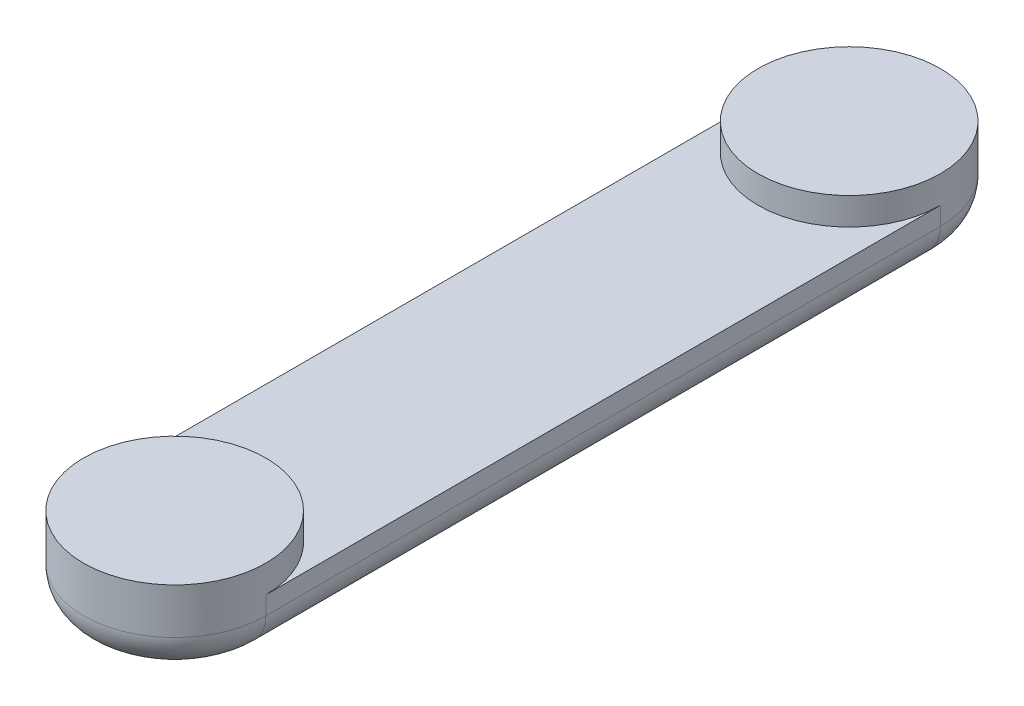
ISO-10303-21;
HEADER;
FILE_DESCRIPTION(('STEP AP214'),'2;1');
FILE_NAME('part.step','',(''),(''),'','','');
FILE_SCHEMA(('AUTOMOTIVE_DESIGN { 1 0 10303 214 1 1 1 1 }'));
ENDSEC;
DATA;
#1=APPLICATION_CONTEXT('core data for automotive mechanical design processes');
#2=APPLICATION_PROTOCOL_DEFINITION('international standard','automotive_design',2000,#1);
#3=PRODUCT_CONTEXT('',#1,'mechanical');
#4=PRODUCT('Part','Part','',(#3));
#5=PRODUCT_RELATED_PRODUCT_CATEGORY('part','',(#4));
#6=PRODUCT_DEFINITION_FORMATION('','',#4);
#7=PRODUCT_DEFINITION_CONTEXT('part definition',#1,'design');
#8=PRODUCT_DEFINITION('design','',#6,#7);
#9=PRODUCT_DEFINITION_SHAPE('','',#8);
#10=(LENGTH_UNIT() NAMED_UNIT(*) SI_UNIT(.MILLI.,.METRE.));
#11=(NAMED_UNIT(*) PLANE_ANGLE_UNIT() SI_UNIT($,.RADIAN.));
#12=(NAMED_UNIT(*) SI_UNIT($,.STERADIAN.) SOLID_ANGLE_UNIT());
#13=UNCERTAINTY_MEASURE_WITH_UNIT(LENGTH_MEASURE(1.E-05),#10,'distance_accuracy_value','');
#14=(GEOMETRIC_REPRESENTATION_CONTEXT(3) GLOBAL_UNCERTAINTY_ASSIGNED_CONTEXT((#13)) GLOBAL_UNIT_ASSIGNED_CONTEXT((#10,
#11,#12)) REPRESENTATION_CONTEXT('',''));
#15=CARTESIAN_POINT('',(0.,0.,0.));
#16=DIRECTION('',(0.,0.,1.));
#17=DIRECTION('',(1.,0.,0.));
#18=AXIS2_PLACEMENT_3D('',#15,#16,#17);
#19=CARTESIAN_POINT('',(0.,3.,0.));
#20=DIRECTION('',(0.,-1.,0.));
#21=DIRECTION('',(0.,0.,-1.));
#22=AXIS2_PLACEMENT_3D('',#19,#20,#21);
#23=CYLINDRICAL_SURFACE('',#22,5.);
#24=DIRECTION('',(0.,-1.,0.));
#25=VECTOR('',#24,1.);
#26=CARTESIAN_POINT('',(-5.,3.,0.));
#27=LINE('',#26,#25);
#28=CARTESIAN_POINT('',(-5.,3.,0.));
#29=VERTEX_POINT('',#28);
#30=CARTESIAN_POINT('',(-5.,2.,0.));
#31=VERTEX_POINT('',#30);
#32=EDGE_CURVE('E136',#29,#31,#27,.T.);
#33=ORIENTED_EDGE('',*,*,#32,.T.);
#34=CARTESIAN_POINT('',(0.,2.,0.));
#35=DIRECTION('',(0.,1.,0.));
#36=DIRECTION('',(0.,0.,1.));
#37=AXIS2_PLACEMENT_3D('',#34,#35,#36);
#38=CIRCLE('',#37,5.);
#39=CARTESIAN_POINT('',(5.,2.,0.));
#40=VERTEX_POINT('',#39);
#41=EDGE_CURVE('E11',#31,#40,#38,.T.);
#42=ORIENTED_EDGE('',*,*,#41,.T.);
#43=DIRECTION('',(0.,-1.,0.));
#44=VECTOR('',#43,1.);
#45=CARTESIAN_POINT('',(5.,3.,0.));
#46=LINE('',#45,#44);
#47=CARTESIAN_POINT('',(5.,3.,0.));
#48=VERTEX_POINT('',#47);
#49=EDGE_CURVE('E114',#48,#40,#46,.T.);
#50=ORIENTED_EDGE('',*,*,#49,.F.);
#51=CARTESIAN_POINT('',(0.,3.,0.));
#52=DIRECTION('',(0.,1.,0.));
#53=DIRECTION('',(0.,0.,1.));
#54=AXIS2_PLACEMENT_3D('',#51,#52,#53);
#55=CIRCLE('',#54,5.);
#56=EDGE_CURVE('E121',#48,#29,#55,.T.);
#57=ORIENTED_EDGE('',*,*,#56,.T.);
#58=EDGE_LOOP('',(#33,#42,#50,#57));
#59=FACE_BOUND('',#58,.T.);
#60=CARTESIAN_POINT('',(0.,4.5,0.));
#61=DIRECTION('',(0.,1.,0.));
#62=DIRECTION('',(0.,0.,1.));
#63=AXIS2_PLACEMENT_3D('',#60,#61,#62);
#64=CIRCLE('',#63,5.);
#65=CARTESIAN_POINT('',(0.,4.5,5.));
#66=VERTEX_POINT('',#65);
#67=EDGE_CURVE('E126',#66,#66,#64,.T.);
#68=ORIENTED_EDGE('',*,*,#67,.F.);
#69=EDGE_LOOP('',(#68));
#70=FACE_BOUND('',#69,.T.);
#71=ADVANCED_FACE('F43',(#59,#70),#23,.T.);
#72=CARTESIAN_POINT('',(5.,3.,0.));
#73=DIRECTION('',(-1.,0.,0.));
#74=DIRECTION('',(0.,0.,1.));
#75=AXIS2_PLACEMENT_3D('',#72,#73,#74);
#76=PLANE('',#75);
#77=ORIENTED_EDGE('',*,*,#49,.T.);
#78=DIRECTION('',(0.,0.,-1.));
#79=VECTOR('',#78,1.);
#80=CARTESIAN_POINT('',(5.,2.,0.));
#81=LINE('',#80,#79);
#82=CARTESIAN_POINT('',(5.,2.,-37.));
#83=VERTEX_POINT('',#82);
#84=EDGE_CURVE('E113',#40,#83,#81,.T.);
#85=ORIENTED_EDGE('',*,*,#84,.T.);
#86=DIRECTION('',(0.,-1.,0.));
#87=VECTOR('',#86,1.);
#88=CARTESIAN_POINT('',(5.,3.,-37.));
#89=LINE('',#88,#87);
#90=CARTESIAN_POINT('',(5.,3.,-37.));
#91=VERTEX_POINT('',#90);
#92=EDGE_CURVE('E108',#91,#83,#89,.T.);
#93=ORIENTED_EDGE('',*,*,#92,.F.);
#94=DIRECTION('',(0.,0.,-1.));
#95=VECTOR('',#94,1.);
#96=CARTESIAN_POINT('',(5.,3.,0.));
#97=LINE('',#96,#95);
#98=EDGE_CURVE('E118',#48,#91,#97,.T.);
#99=ORIENTED_EDGE('',*,*,#98,.F.);
#100=EDGE_LOOP('',(#77,#85,#93,#99));
#101=FACE_BOUND('',#100,.T.);
#102=ADVANCED_FACE('F129',(#101),#76,.F.);
#103=CARTESIAN_POINT('',(0.,3.,-37.));
#104=DIRECTION('',(0.,-1.,0.));
#105=DIRECTION('',(0.,0.,-1.));
#106=AXIS2_PLACEMENT_3D('',#103,#104,#105);
#107=CYLINDRICAL_SURFACE('',#106,5.);
#108=ORIENTED_EDGE('',*,*,#92,.T.);
#109=CARTESIAN_POINT('',(0.,2.,-37.));
#110=DIRECTION('',(0.,1.,0.));
#111=DIRECTION('',(0.,0.,1.));
#112=AXIS2_PLACEMENT_3D('',#109,#110,#111);
#113=CIRCLE('',#112,5.);
#114=CARTESIAN_POINT('',(-5.,2.,-37.));
#115=VERTEX_POINT('',#114);
#116=EDGE_CURVE('E70',#83,#115,#113,.T.);
#117=ORIENTED_EDGE('',*,*,#116,.T.);
#118=DIRECTION('',(0.,-1.,0.));
#119=VECTOR('',#118,1.);
#120=CARTESIAN_POINT('',(-5.,3.,-37.));
#121=LINE('',#120,#119);
#122=CARTESIAN_POINT('',(-5.,3.,-37.));
#123=VERTEX_POINT('',#122);
#124=EDGE_CURVE('E109',#123,#115,#121,.T.);
#125=ORIENTED_EDGE('',*,*,#124,.F.);
#126=CARTESIAN_POINT('',(0.,3.,-37.));
#127=DIRECTION('',(0.,1.,0.));
#128=DIRECTION('',(0.,0.,1.));
#129=AXIS2_PLACEMENT_3D('',#126,#127,#128);
#130=CIRCLE('',#129,5.);
#131=EDGE_CURVE('E103',#91,#123,#130,.F.);
#132=ORIENTED_EDGE('',*,*,#131,.F.);
#133=EDGE_LOOP('',(#108,#117,#125,#132));
#134=FACE_BOUND('',#133,.T.);
#135=CARTESIAN_POINT('',(0.,4.5,-37.));
#136=DIRECTION('',(0.,1.,0.));
#137=DIRECTION('',(0.,0.,1.));
#138=AXIS2_PLACEMENT_3D('',#135,#136,#137);
#139=CIRCLE('',#138,5.);
#140=CARTESIAN_POINT('',(0.,4.5,-32.));
#141=VERTEX_POINT('',#140);
#142=EDGE_CURVE('E172',#141,#141,#139,.T.);
#143=ORIENTED_EDGE('',*,*,#142,.F.);
#144=EDGE_LOOP('',(#143));
#145=FACE_BOUND('',#144,.T.);
#146=ADVANCED_FACE('F105',(#134,#145),#107,.T.);
#147=CARTESIAN_POINT('',(-5.,3.,0.));
#148=DIRECTION('',(1.,0.,0.));
#149=DIRECTION('',(0.,0.,-1.));
#150=AXIS2_PLACEMENT_3D('',#147,#148,#149);
#151=PLANE('',#150);
#152=ORIENTED_EDGE('',*,*,#124,.T.);
#153=DIRECTION('',(0.,0.,1.));
#154=VECTOR('',#153,1.);
#155=CARTESIAN_POINT('',(-5.,2.,0.));
#156=LINE('',#155,#154);
#157=EDGE_CURVE('E53',#115,#31,#156,.T.);
#158=ORIENTED_EDGE('',*,*,#157,.T.);
#159=ORIENTED_EDGE('',*,*,#32,.F.);
#160=DIRECTION('',(0.,0.,1.));
#161=VECTOR('',#160,1.);
#162=CARTESIAN_POINT('',(-5.,3.,0.));
#163=LINE('',#162,#161);
#164=EDGE_CURVE('E125',#123,#29,#163,.T.);
#165=ORIENTED_EDGE('',*,*,#164,.F.);
#166=EDGE_LOOP('',(#152,#158,#159,#165));
#167=FACE_BOUND('',#166,.T.);
#168=ADVANCED_FACE('F217',(#167),#151,.F.);
#169=CARTESIAN_POINT('',(0.,3.,0.));
#170=DIRECTION('',(0.,1.,0.));
#171=DIRECTION('',(0.,0.,1.));
#172=AXIS2_PLACEMENT_3D('',#169,#170,#171);
#173=PLANE('',#172);
#174=ORIENTED_EDGE('',*,*,#98,.T.);
#175=ORIENTED_EDGE('',*,*,#131,.T.);
#176=ORIENTED_EDGE('',*,*,#164,.T.);
#177=ORIENTED_EDGE('',*,*,#56,.F.);
#178=EDGE_LOOP('',(#174,#175,#176,#177));
#179=FACE_BOUND('',#178,.T.);
#180=ADVANCED_FACE('F119',(#179),#173,.T.);
#181=CARTESIAN_POINT('',(0.,0.,0.));
#182=DIRECTION('',(0.,1.,0.));
#183=DIRECTION('',(0.,0.,1.));
#184=AXIS2_PLACEMENT_3D('',#181,#182,#183);
#185=PLANE('',#184);
#186=CARTESIAN_POINT('',(0.,0.,-37.));
#187=DIRECTION('',(0.,1.,0.));
#188=DIRECTION('',(0.,0.,1.));
#189=AXIS2_PLACEMENT_3D('',#186,#187,#188);
#190=CIRCLE('',#189,3.);
#191=CARTESIAN_POINT('',(-3.,0.,-37.));
#192=VERTEX_POINT('',#191);
#193=CARTESIAN_POINT('',(3.,0.,-37.));
#194=VERTEX_POINT('',#193);
#195=EDGE_CURVE('E148',#192,#194,#190,.F.);
#196=ORIENTED_EDGE('',*,*,#195,.T.);
#197=DIRECTION('',(0.,0.,-1.));
#198=VECTOR('',#197,1.);
#199=CARTESIAN_POINT('',(3.,0.,0.));
#200=LINE('',#199,#198);
#201=CARTESIAN_POINT('',(3.,0.,0.));
#202=VERTEX_POINT('',#201);
#203=EDGE_CURVE('E151',#194,#202,#200,.F.);
#204=ORIENTED_EDGE('',*,*,#203,.T.);
#205=CARTESIAN_POINT('',(0.,0.,0.));
#206=DIRECTION('',(0.,1.,0.));
#207=DIRECTION('',(0.,0.,1.));
#208=AXIS2_PLACEMENT_3D('',#205,#206,#207);
#209=CIRCLE('',#208,3.);
#210=CARTESIAN_POINT('',(-3.,0.,0.));
#211=VERTEX_POINT('',#210);
#212=EDGE_CURVE('E142',#202,#211,#209,.F.);
#213=ORIENTED_EDGE('',*,*,#212,.T.);
#214=DIRECTION('',(0.,0.,1.));
#215=VECTOR('',#214,1.);
#216=CARTESIAN_POINT('',(-3.,0.,0.));
#217=LINE('',#216,#215);
#218=EDGE_CURVE('E145',#211,#192,#217,.F.);
#219=ORIENTED_EDGE('',*,*,#218,.T.);
#220=EDGE_LOOP('',(#196,#204,#213,#219));
#221=FACE_BOUND('',#220,.T.);
#222=ADVANCED_FACE('F220',(#221),#185,.F.);
#223=CARTESIAN_POINT('',(0.,4.5,0.));
#224=DIRECTION('',(0.,1.,0.));
#225=DIRECTION('',(0.,0.,1.));
#226=AXIS2_PLACEMENT_3D('',#223,#224,#225);
#227=PLANE('',#226);
#228=ORIENTED_EDGE('',*,*,#67,.T.);
#229=EDGE_LOOP('',(#228));
#230=FACE_BOUND('',#229,.T.);
#231=ADVANCED_FACE('F223',(#230),#227,.T.);
#232=CARTESIAN_POINT('',(0.,4.5,-37.));
#233=DIRECTION('',(0.,1.,0.));
#234=DIRECTION('',(0.,0.,1.));
#235=AXIS2_PLACEMENT_3D('',#232,#233,#234);
#236=PLANE('',#235);
#237=ORIENTED_EDGE('',*,*,#142,.T.);
#238=EDGE_LOOP('',(#237));
#239=FACE_BOUND('',#238,.T.);
#240=ADVANCED_FACE('F229',(#239),#236,.T.);
#241=CARTESIAN_POINT('',(-3.,2.,0.));
#242=DIRECTION('',(0.,0.,1.));
#243=DIRECTION('',(1.,0.,0.));
#244=AXIS2_PLACEMENT_3D('',#241,#242,#243);
#245=CYLINDRICAL_SURFACE('',#244,2.);
#246=CARTESIAN_POINT('',(-3.,2.,-37.));
#247=DIRECTION('',(0.,0.,-1.));
#248=DIRECTION('',(-1.,0.,0.));
#249=AXIS2_PLACEMENT_3D('',#246,#247,#248);
#250=CIRCLE('',#249,2.);
#251=EDGE_CURVE('E164',#192,#115,#250,.T.);
#252=ORIENTED_EDGE('',*,*,#251,.F.);
#253=ORIENTED_EDGE('',*,*,#218,.F.);
#254=CARTESIAN_POINT('',(-3.,2.,0.));
#255=DIRECTION('',(0.,0.,1.));
#256=DIRECTION('',(1.,0.,0.));
#257=AXIS2_PLACEMENT_3D('',#254,#255,#256);
#258=CIRCLE('',#257,2.);
#259=EDGE_CURVE('E47',#31,#211,#258,.T.);
#260=ORIENTED_EDGE('',*,*,#259,.F.);
#261=ORIENTED_EDGE('',*,*,#157,.F.);
#262=EDGE_LOOP('',(#252,#253,#260,#261));
#263=FACE_BOUND('',#262,.T.);
#264=ADVANCED_FACE('F45',(#263),#245,.T.);
#265=CARTESIAN_POINT('',(0.,2.,0.));
#266=DIRECTION('',(0.,1.,0.));
#267=DIRECTION('',(0.,0.,1.));
#268=AXIS2_PLACEMENT_3D('',#265,#266,#267);
#269=TOROIDAL_SURFACE('',#268,3.,2.);
#270=ORIENTED_EDGE('',*,*,#259,.T.);
#271=ORIENTED_EDGE('',*,*,#212,.F.);
#272=CARTESIAN_POINT('',(3.,2.,0.));
#273=DIRECTION('',(0.,0.,-1.));
#274=DIRECTION('',(-1.,0.,0.));
#275=AXIS2_PLACEMENT_3D('',#272,#273,#274);
#276=CIRCLE('',#275,2.);
#277=EDGE_CURVE('E162',#40,#202,#276,.T.);
#278=ORIENTED_EDGE('',*,*,#277,.F.);
#279=ORIENTED_EDGE('',*,*,#41,.F.);
#280=EDGE_LOOP('',(#270,#271,#278,#279));
#281=FACE_BOUND('',#280,.T.);
#282=ADVANCED_FACE('F195',(#281),#269,.T.);
#283=CARTESIAN_POINT('',(0.,2.,-37.));
#284=DIRECTION('',(0.,1.,0.));
#285=DIRECTION('',(0.,0.,1.));
#286=AXIS2_PLACEMENT_3D('',#283,#284,#285);
#287=TOROIDAL_SURFACE('',#286,3.,2.);
#288=ORIENTED_EDGE('',*,*,#251,.T.);
#289=ORIENTED_EDGE('',*,*,#116,.F.);
#290=CARTESIAN_POINT('',(3.,2.,-37.));
#291=DIRECTION('',(0.,0.,1.));
#292=DIRECTION('',(1.,0.,0.));
#293=AXIS2_PLACEMENT_3D('',#290,#291,#292);
#294=CIRCLE('',#293,2.);
#295=EDGE_CURVE('E159',#194,#83,#294,.T.);
#296=ORIENTED_EDGE('',*,*,#295,.F.);
#297=ORIENTED_EDGE('',*,*,#195,.F.);
#298=EDGE_LOOP('',(#288,#289,#296,#297));
#299=FACE_BOUND('',#298,.T.);
#300=ADVANCED_FACE('F200',(#299),#287,.T.);
#301=CARTESIAN_POINT('',(3.,2.,0.));
#302=DIRECTION('',(0.,0.,-1.));
#303=DIRECTION('',(-1.,0.,0.));
#304=AXIS2_PLACEMENT_3D('',#301,#302,#303);
#305=CYLINDRICAL_SURFACE('',#304,2.);
#306=ORIENTED_EDGE('',*,*,#277,.T.);
#307=ORIENTED_EDGE('',*,*,#203,.F.);
#308=ORIENTED_EDGE('',*,*,#295,.T.);
#309=ORIENTED_EDGE('',*,*,#84,.F.);
#310=EDGE_LOOP('',(#306,#307,#308,#309));
#311=FACE_BOUND('',#310,.T.);
#312=ADVANCED_FACE('F198',(#311),#305,.T.);
#313=CLOSED_SHELL('',(#71,#102,#146,#168,#180,#222,#231,#240,#264,#282,#300,#312));
#314=MANIFOLD_SOLID_BREP('B2',#313);
#315=ADVANCED_BREP_SHAPE_REPRESENTATION('',(#18,#314),#14);
#316=SHAPE_DEFINITION_REPRESENTATION(#9,#315);
ENDSEC;
END-ISO-10303-21;
